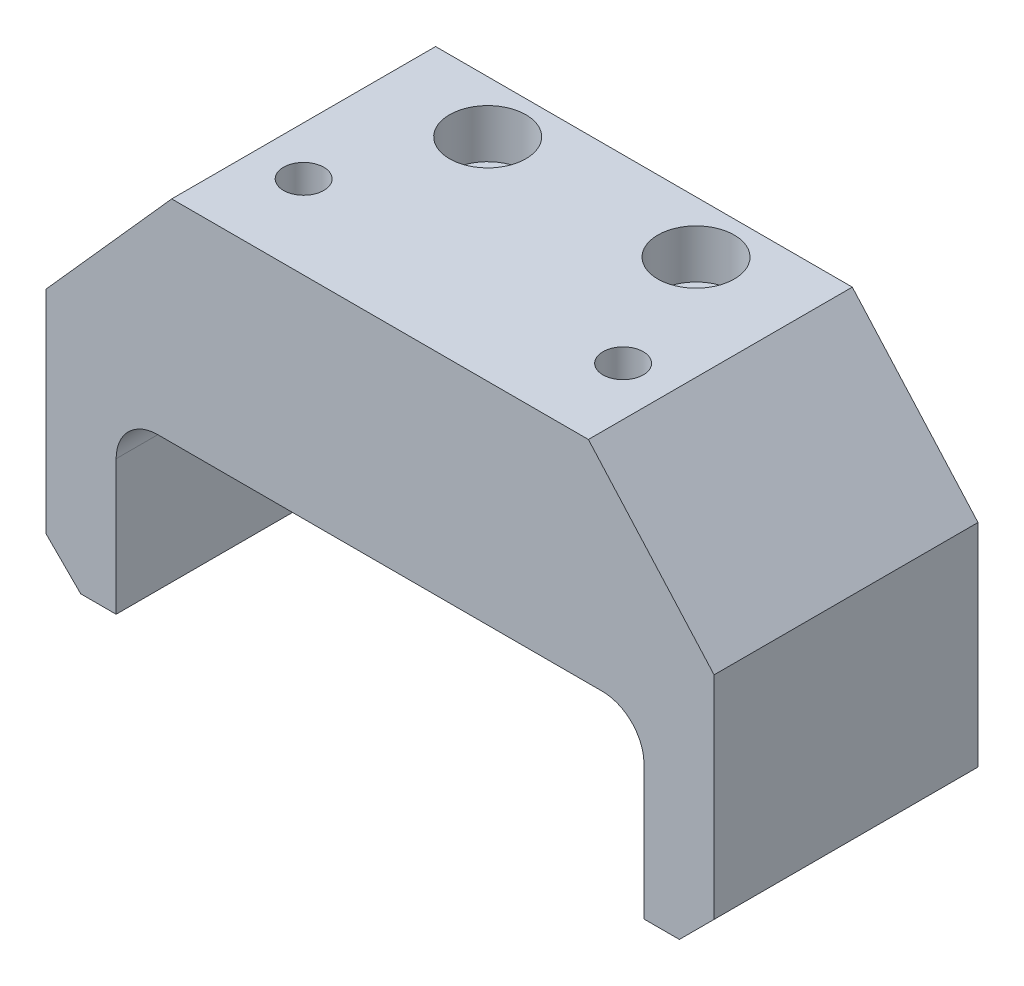
ISO-10303-21;
HEADER;
FILE_DESCRIPTION(('STEP AP214'),'2;1');
FILE_NAME('part.step','',(''),(''),'','','');
FILE_SCHEMA(('AUTOMOTIVE_DESIGN { 1 0 10303 214 1 1 1 1 }'));
ENDSEC;
DATA;
#1=APPLICATION_CONTEXT('core data for automotive mechanical design processes');
#2=APPLICATION_PROTOCOL_DEFINITION('international standard','automotive_design',2000,#1);
#3=PRODUCT_CONTEXT('',#1,'mechanical');
#4=PRODUCT('Part','Part','',(#3));
#5=PRODUCT_RELATED_PRODUCT_CATEGORY('part','',(#4));
#6=PRODUCT_DEFINITION_FORMATION('','',#4);
#7=PRODUCT_DEFINITION_CONTEXT('part definition',#1,'design');
#8=PRODUCT_DEFINITION('design','',#6,#7);
#9=PRODUCT_DEFINITION_SHAPE('','',#8);
#10=(LENGTH_UNIT() NAMED_UNIT(*) SI_UNIT(.MILLI.,.METRE.));
#11=(NAMED_UNIT(*) PLANE_ANGLE_UNIT() SI_UNIT($,.RADIAN.));
#12=(NAMED_UNIT(*) SI_UNIT($,.STERADIAN.) SOLID_ANGLE_UNIT());
#13=UNCERTAINTY_MEASURE_WITH_UNIT(LENGTH_MEASURE(1.E-05),#10,'distance_accuracy_value','');
#14=(GEOMETRIC_REPRESENTATION_CONTEXT(3) GLOBAL_UNCERTAINTY_ASSIGNED_CONTEXT((#13)) GLOBAL_UNIT_ASSIGNED_CONTEXT((#10,
#11,#12)) REPRESENTATION_CONTEXT('',''));
#15=CARTESIAN_POINT('',(0.,0.,0.));
#16=DIRECTION('',(0.,0.,1.));
#17=DIRECTION('',(1.,0.,0.));
#18=AXIS2_PLACEMENT_3D('',#15,#16,#17);
#19=CARTESIAN_POINT('',(15.,-36.,-11.5));
#20=DIRECTION('',(0.,1.,0.));
#21=DIRECTION('',(-1.,0.,0.));
#22=AXIS2_PLACEMENT_3D('',#19,#20,#21);
#23=CYLINDRICAL_SURFACE('',#22,3.05);
#24=CARTESIAN_POINT('',(15.,-24.4,-11.5));
#25=DIRECTION('',(0.,1.,0.));
#26=DIRECTION('',(-1.,0.,0.));
#27=AXIS2_PLACEMENT_3D('',#24,#25,#26);
#28=CIRCLE('',#27,3.05);
#29=CARTESIAN_POINT('',(11.95,-24.4,-11.5));
#30=VERTEX_POINT('',#29);
#31=EDGE_CURVE('E198',#30,#30,#28,.T.);
#32=ORIENTED_EDGE('',*,*,#31,.F.);
#33=EDGE_LOOP('',(#32));
#34=FACE_BOUND('',#33,.T.);
#35=CARTESIAN_POINT('',(15.,-1.,-11.5));
#36=DIRECTION('',(0.,1.,0.));
#37=DIRECTION('',(-1.,0.,0.));
#38=AXIS2_PLACEMENT_3D('',#35,#36,#37);
#39=CIRCLE('',#38,3.05);
#40=CARTESIAN_POINT('',(11.95,-1.,-11.5));
#41=VERTEX_POINT('',#40);
#42=EDGE_CURVE('E200',#41,#41,#39,.F.);
#43=ORIENTED_EDGE('',*,*,#42,.F.);
#44=EDGE_LOOP('',(#43));
#45=FACE_BOUND('',#44,.T.);
#46=ADVANCED_FACE('F35',(#34,#45),#23,.F.);
#47=CARTESIAN_POINT('',(-15.,-36.,-11.5));
#48=DIRECTION('',(0.,1.,0.));
#49=DIRECTION('',(-1.,0.,0.));
#50=AXIS2_PLACEMENT_3D('',#47,#48,#49);
#51=CYLINDRICAL_SURFACE('',#50,3.05);
#52=CARTESIAN_POINT('',(-15.,-24.4,-11.5));
#53=DIRECTION('',(0.,1.,0.));
#54=DIRECTION('',(-1.,0.,0.));
#55=AXIS2_PLACEMENT_3D('',#52,#53,#54);
#56=CIRCLE('',#55,3.05);
#57=CARTESIAN_POINT('',(-18.05,-24.4,-11.5));
#58=VERTEX_POINT('',#57);
#59=EDGE_CURVE('E276',#58,#58,#56,.T.);
#60=ORIENTED_EDGE('',*,*,#59,.F.);
#61=EDGE_LOOP('',(#60));
#62=FACE_BOUND('',#61,.T.);
#63=CARTESIAN_POINT('',(-15.,-1.00000000000001,-11.5));
#64=DIRECTION('',(0.,1.,0.));
#65=DIRECTION('',(-1.,0.,0.));
#66=AXIS2_PLACEMENT_3D('',#63,#64,#65);
#67=CIRCLE('',#66,3.05);
#68=CARTESIAN_POINT('',(-18.05,-1.00000000000001,-11.5));
#69=VERTEX_POINT('',#68);
#70=EDGE_CURVE('E195',#69,#69,#67,.F.);
#71=ORIENTED_EDGE('',*,*,#70,.F.);
#72=EDGE_LOOP('',(#71));
#73=FACE_BOUND('',#72,.T.);
#74=ADVANCED_FACE('F341',(#62,#73),#51,.F.);
#75=CARTESIAN_POINT('',(-48.1,5.99999999999999,19.));
#76=DIRECTION('',(1.,0.,0.));
#77=DIRECTION('',(0.,1.,0.));
#78=AXIS2_PLACEMENT_3D('',#75,#76,#77);
#79=PLANE('',#78);
#80=DIRECTION('',(0.,-1.,0.));
#81=VECTOR('',#80,1.);
#82=CARTESIAN_POINT('',(-48.1,5.99999999999999,-19.));
#83=LINE('',#82,#81);
#84=CARTESIAN_POINT('',(-48.1,-14.3,-19.));
#85=VERTEX_POINT('',#84);
#86=CARTESIAN_POINT('',(-48.1,-44.8,-19.));
#87=VERTEX_POINT('',#86);
#88=EDGE_CURVE('E226',#85,#87,#83,.T.);
#89=ORIENTED_EDGE('',*,*,#88,.T.);
#90=DIRECTION('',(0.,0.,1.));
#91=VECTOR('',#90,1.);
#92=CARTESIAN_POINT('',(-48.1,-44.8,19.));
#93=LINE('',#92,#91);
#94=CARTESIAN_POINT('',(-48.1,-44.8,19.));
#95=VERTEX_POINT('',#94);
#96=EDGE_CURVE('E11',#87,#95,#93,.T.);
#97=ORIENTED_EDGE('',*,*,#96,.T.);
#98=DIRECTION('',(0.,-1.,0.));
#99=VECTOR('',#98,1.);
#100=CARTESIAN_POINT('',(-48.1,5.99999999999999,19.));
#101=LINE('',#100,#99);
#102=CARTESIAN_POINT('',(-48.1,-14.3,19.));
#103=VERTEX_POINT('',#102);
#104=EDGE_CURVE('E161',#103,#95,#101,.T.);
#105=ORIENTED_EDGE('',*,*,#104,.F.);
#106=DIRECTION('',(0.,0.,1.));
#107=VECTOR('',#106,1.);
#108=CARTESIAN_POINT('',(-48.1,-14.3,-19.));
#109=LINE('',#108,#107);
#110=EDGE_CURVE('E268',#85,#103,#109,.T.);
#111=ORIENTED_EDGE('',*,*,#110,.F.);
#112=EDGE_LOOP('',(#89,#97,#105,#111));
#113=FACE_BOUND('',#112,.T.);
#114=ADVANCED_FACE('F346',(#113),#79,.F.);
#115=CARTESIAN_POINT('',(-48.1,-49.8,19.));
#116=DIRECTION('',(0.,1.,0.));
#117=DIRECTION('',(-1.,0.,0.));
#118=AXIS2_PLACEMENT_3D('',#115,#116,#117);
#119=PLANE('',#118);
#120=DIRECTION('',(1.,0.,0.));
#121=VECTOR('',#120,1.);
#122=CARTESIAN_POINT('',(-48.1,-49.8,19.));
#123=LINE('',#122,#121);
#124=CARTESIAN_POINT('',(-43.1,-49.8,19.));
#125=VERTEX_POINT('',#124);
#126=CARTESIAN_POINT('',(-38.,-49.8,19.));
#127=VERTEX_POINT('',#126);
#128=EDGE_CURVE('E164',#125,#127,#123,.T.);
#129=ORIENTED_EDGE('',*,*,#128,.F.);
#130=DIRECTION('',(0.,0.,-1.));
#131=VECTOR('',#130,1.);
#132=CARTESIAN_POINT('',(-43.1,-49.8,19.));
#133=LINE('',#132,#131);
#134=CARTESIAN_POINT('',(-43.1,-49.8,-19.));
#135=VERTEX_POINT('',#134);
#136=EDGE_CURVE('E43',#125,#135,#133,.T.);
#137=ORIENTED_EDGE('',*,*,#136,.T.);
#138=DIRECTION('',(1.,0.,0.));
#139=VECTOR('',#138,1.);
#140=CARTESIAN_POINT('',(-48.1,-49.8,-19.));
#141=LINE('',#140,#139);
#142=CARTESIAN_POINT('',(-38.,-49.8,-19.));
#143=VERTEX_POINT('',#142);
#144=EDGE_CURVE('E221',#135,#143,#141,.T.);
#145=ORIENTED_EDGE('',*,*,#144,.T.);
#146=DIRECTION('',(0.,0.,-1.));
#147=VECTOR('',#146,1.);
#148=CARTESIAN_POINT('',(-38.,-49.8,19.));
#149=LINE('',#148,#147);
#150=EDGE_CURVE('E173',#127,#143,#149,.T.);
#151=ORIENTED_EDGE('',*,*,#150,.F.);
#152=EDGE_LOOP('',(#129,#137,#145,#151));
#153=FACE_BOUND('',#152,.T.);
#154=ADVANCED_FACE('F219',(#153),#119,.F.);
#155=CARTESIAN_POINT('',(-38.,-49.8,19.));
#156=DIRECTION('',(-1.,0.,0.));
#157=DIRECTION('',(0.,0.,1.));
#158=AXIS2_PLACEMENT_3D('',#155,#156,#157);
#159=PLANE('',#158);
#160=DIRECTION('',(0.,1.,0.));
#161=VECTOR('',#160,1.);
#162=CARTESIAN_POINT('',(-38.,-49.8,-19.));
#163=LINE('',#162,#161);
#164=CARTESIAN_POINT('',(-38.,-30.4,-19.));
#165=VERTEX_POINT('',#164);
#166=EDGE_CURVE('E225',#143,#165,#163,.T.);
#167=ORIENTED_EDGE('',*,*,#166,.T.);
#168=DIRECTION('',(0.,0.,-1.));
#169=VECTOR('',#168,1.);
#170=CARTESIAN_POINT('',(-38.,-30.4,19.));
#171=LINE('',#170,#169);
#172=CARTESIAN_POINT('',(-38.,-30.4,19.));
#173=VERTEX_POINT('',#172);
#174=EDGE_CURVE('E184',#165,#173,#171,.F.);
#175=ORIENTED_EDGE('',*,*,#174,.T.);
#176=DIRECTION('',(0.,1.,0.));
#177=VECTOR('',#176,1.);
#178=CARTESIAN_POINT('',(-38.,-49.8,19.));
#179=LINE('',#178,#177);
#180=EDGE_CURVE('E264',#127,#173,#179,.T.);
#181=ORIENTED_EDGE('',*,*,#180,.F.);
#182=ORIENTED_EDGE('',*,*,#150,.T.);
#183=EDGE_LOOP('',(#167,#175,#181,#182));
#184=FACE_BOUND('',#183,.T.);
#185=ADVANCED_FACE('F374',(#184),#159,.F.);
#186=CARTESIAN_POINT('',(-38.,-24.4,19.));
#187=DIRECTION('',(0.,1.,0.));
#188=DIRECTION('',(-1.,0.,0.));
#189=AXIS2_PLACEMENT_3D('',#186,#187,#188);
#190=PLANE('',#189);
#191=ORIENTED_EDGE('',*,*,#31,.T.);
#192=EDGE_LOOP('',(#191));
#193=FACE_BOUND('',#192,.T.);
#194=ORIENTED_EDGE('',*,*,#59,.T.);
#195=EDGE_LOOP('',(#194));
#196=FACE_BOUND('',#195,.T.);
#197=DIRECTION('',(1.,0.,0.));
#198=VECTOR('',#197,1.);
#199=CARTESIAN_POINT('',(-38.,-24.4,-19.));
#200=LINE('',#199,#198);
#201=CARTESIAN_POINT('',(-32.,-24.4,-19.));
#202=VERTEX_POINT('',#201);
#203=CARTESIAN_POINT('',(32.,-24.4,-19.));
#204=VERTEX_POINT('',#203);
#205=EDGE_CURVE('E228',#202,#204,#200,.T.);
#206=ORIENTED_EDGE('',*,*,#205,.T.);
#207=DIRECTION('',(0.,0.,-1.));
#208=VECTOR('',#207,1.);
#209=CARTESIAN_POINT('',(32.,-24.4,19.));
#210=LINE('',#209,#208);
#211=CARTESIAN_POINT('',(32.,-24.4,19.));
#212=VERTEX_POINT('',#211);
#213=EDGE_CURVE('E182',#204,#212,#210,.F.);
#214=ORIENTED_EDGE('',*,*,#213,.T.);
#215=DIRECTION('',(1.,0.,0.));
#216=VECTOR('',#215,1.);
#217=CARTESIAN_POINT('',(-38.,-24.4,19.));
#218=LINE('',#217,#216);
#219=CARTESIAN_POINT('',(-32.,-24.4,19.));
#220=VERTEX_POINT('',#219);
#221=EDGE_CURVE('E261',#220,#212,#218,.T.);
#222=ORIENTED_EDGE('',*,*,#221,.F.);
#223=DIRECTION('',(0.,0.,-1.));
#224=VECTOR('',#223,1.);
#225=CARTESIAN_POINT('',(-32.,-24.4,-19.));
#226=LINE('',#225,#224);
#227=EDGE_CURVE('E179',#220,#202,#226,.T.);
#228=ORIENTED_EDGE('',*,*,#227,.T.);
#229=EDGE_LOOP('',(#206,#214,#222,#228));
#230=FACE_BOUND('',#229,.T.);
#231=ADVANCED_FACE('F370',(#193,#196,#230),#190,.F.);
#232=CARTESIAN_POINT('',(38.,-49.8,19.));
#233=DIRECTION('',(1.,0.,0.));
#234=DIRECTION('',(0.,0.,-1.));
#235=AXIS2_PLACEMENT_3D('',#232,#233,#234);
#236=PLANE('',#235);
#237=DIRECTION('',(0.,-1.,0.));
#238=VECTOR('',#237,1.);
#239=CARTESIAN_POINT('',(38.,-49.8,19.));
#240=LINE('',#239,#238);
#241=CARTESIAN_POINT('',(38.,-30.4,19.));
#242=VERTEX_POINT('',#241);
#243=CARTESIAN_POINT('',(38.,-49.8,19.));
#244=VERTEX_POINT('',#243);
#245=EDGE_CURVE('E257',#242,#244,#240,.T.);
#246=ORIENTED_EDGE('',*,*,#245,.F.);
#247=DIRECTION('',(0.,0.,-1.));
#248=VECTOR('',#247,1.);
#249=CARTESIAN_POINT('',(38.,-30.4,-19.));
#250=LINE('',#249,#248);
#251=CARTESIAN_POINT('',(38.,-30.4,-19.));
#252=VERTEX_POINT('',#251);
#253=EDGE_CURVE('E176',#242,#252,#250,.T.);
#254=ORIENTED_EDGE('',*,*,#253,.T.);
#255=DIRECTION('',(0.,-1.,0.));
#256=VECTOR('',#255,1.);
#257=CARTESIAN_POINT('',(38.,-49.8,-19.));
#258=LINE('',#257,#256);
#259=CARTESIAN_POINT('',(38.,-49.8,-19.));
#260=VERTEX_POINT('',#259);
#261=EDGE_CURVE('E236',#252,#260,#258,.T.);
#262=ORIENTED_EDGE('',*,*,#261,.T.);
#263=DIRECTION('',(0.,0.,-1.));
#264=VECTOR('',#263,1.);
#265=CARTESIAN_POINT('',(38.,-49.8,19.));
#266=LINE('',#265,#264);
#267=EDGE_CURVE('E170',#244,#260,#266,.T.);
#268=ORIENTED_EDGE('',*,*,#267,.F.);
#269=EDGE_LOOP('',(#246,#254,#262,#268));
#270=FACE_BOUND('',#269,.T.);
#271=ADVANCED_FACE('F367',(#270),#236,.F.);
#272=CARTESIAN_POINT('',(48.1,-49.8,19.));
#273=DIRECTION('',(0.,1.,0.));
#274=DIRECTION('',(0.,0.,1.));
#275=AXIS2_PLACEMENT_3D('',#272,#273,#274);
#276=PLANE('',#275);
#277=DIRECTION('',(1.,0.,0.));
#278=VECTOR('',#277,1.);
#279=CARTESIAN_POINT('',(48.1,-49.8,-19.));
#280=LINE('',#279,#278);
#281=CARTESIAN_POINT('',(43.1,-49.8,-19.));
#282=VERTEX_POINT('',#281);
#283=EDGE_CURVE('E166',#260,#282,#280,.T.);
#284=ORIENTED_EDGE('',*,*,#283,.T.);
#285=DIRECTION('',(0.,0.,1.));
#286=VECTOR('',#285,1.);
#287=CARTESIAN_POINT('',(43.1,-49.8,19.));
#288=LINE('',#287,#286);
#289=CARTESIAN_POINT('',(43.1,-49.8,19.));
#290=VERTEX_POINT('',#289);
#291=EDGE_CURVE('E211',#282,#290,#288,.T.);
#292=ORIENTED_EDGE('',*,*,#291,.T.);
#293=DIRECTION('',(1.,0.,0.));
#294=VECTOR('',#293,1.);
#295=CARTESIAN_POINT('',(48.1,-49.8,19.));
#296=LINE('',#295,#294);
#297=EDGE_CURVE('E253',#244,#290,#296,.T.);
#298=ORIENTED_EDGE('',*,*,#297,.F.);
#299=ORIENTED_EDGE('',*,*,#267,.T.);
#300=EDGE_LOOP('',(#284,#292,#298,#299));
#301=FACE_BOUND('',#300,.T.);
#302=ADVANCED_FACE('F241',(#301),#276,.F.);
#303=CARTESIAN_POINT('',(48.1,6.,19.));
#304=DIRECTION('',(-1.,0.,0.));
#305=DIRECTION('',(0.,-1.,0.));
#306=AXIS2_PLACEMENT_3D('',#303,#304,#305);
#307=PLANE('',#306);
#308=DIRECTION('',(0.,1.,0.));
#309=VECTOR('',#308,1.);
#310=CARTESIAN_POINT('',(48.1,6.,19.));
#311=LINE('',#310,#309);
#312=CARTESIAN_POINT('',(48.1,-44.8,19.));
#313=VERTEX_POINT('',#312);
#314=CARTESIAN_POINT('',(48.1,-14.3,19.));
#315=VERTEX_POINT('',#314);
#316=EDGE_CURVE('E252',#313,#315,#311,.T.);
#317=ORIENTED_EDGE('',*,*,#316,.F.);
#318=DIRECTION('',(0.,0.,-1.));
#319=VECTOR('',#318,1.);
#320=CARTESIAN_POINT('',(48.1,-44.8,19.));
#321=LINE('',#320,#319);
#322=CARTESIAN_POINT('',(48.1,-44.8,-19.));
#323=VERTEX_POINT('',#322);
#324=EDGE_CURVE('E194',#313,#323,#321,.T.);
#325=ORIENTED_EDGE('',*,*,#324,.T.);
#326=DIRECTION('',(0.,1.,0.));
#327=VECTOR('',#326,1.);
#328=CARTESIAN_POINT('',(48.1,6.,-19.));
#329=LINE('',#328,#327);
#330=CARTESIAN_POINT('',(48.1,-14.3,-19.));
#331=VERTEX_POINT('',#330);
#332=EDGE_CURVE('E162',#323,#331,#329,.T.);
#333=ORIENTED_EDGE('',*,*,#332,.T.);
#334=DIRECTION('',(0.,0.,1.));
#335=VECTOR('',#334,1.);
#336=CARTESIAN_POINT('',(48.1,-14.3,-19.));
#337=LINE('',#336,#335);
#338=EDGE_CURVE('E143',#331,#315,#337,.T.);
#339=ORIENTED_EDGE('',*,*,#338,.T.);
#340=EDGE_LOOP('',(#317,#325,#333,#339));
#341=FACE_BOUND('',#340,.T.);
#342=ADVANCED_FACE('F255',(#341),#307,.F.);
#343=CARTESIAN_POINT('',(48.1,6.,19.));
#344=DIRECTION('',(0.,-1.,0.));
#345=DIRECTION('',(1.,0.,0.));
#346=AXIS2_PLACEMENT_3D('',#343,#344,#345);
#347=PLANE('',#346);
#348=CARTESIAN_POINT('',(23.,6.,7.));
#349=DIRECTION('',(0.,1.,0.));
#350=DIRECTION('',(1.,0.,0.));
#351=AXIS2_PLACEMENT_3D('',#348,#349,#350);
#352=CIRCLE('',#351,2.9);
#353=CARTESIAN_POINT('',(25.9,6.,7.));
#354=VERTEX_POINT('',#353);
#355=EDGE_CURVE('E298',#354,#354,#352,.T.);
#356=ORIENTED_EDGE('',*,*,#355,.F.);
#357=EDGE_LOOP('',(#356));
#358=FACE_BOUND('',#357,.T.);
#359=CARTESIAN_POINT('',(-23.,5.99999999999999,7.));
#360=DIRECTION('',(0.,1.,0.));
#361=DIRECTION('',(-1.,0.,0.));
#362=AXIS2_PLACEMENT_3D('',#359,#360,#361);
#363=CIRCLE('',#362,2.9);
#364=CARTESIAN_POINT('',(-25.9,5.99999999999999,7.));
#365=VERTEX_POINT('',#364);
#366=EDGE_CURVE('E292',#365,#365,#363,.T.);
#367=ORIENTED_EDGE('',*,*,#366,.F.);
#368=EDGE_LOOP('',(#367));
#369=FACE_BOUND('',#368,.T.);
#370=CARTESIAN_POINT('',(15.,6.,-11.5));
#371=DIRECTION('',(0.,1.,0.));
#372=DIRECTION('',(-1.,0.,0.));
#373=AXIS2_PLACEMENT_3D('',#370,#371,#372);
#374=CIRCLE('',#373,5.5);
#375=CARTESIAN_POINT('',(9.50000000000001,6.,-11.5));
#376=VERTEX_POINT('',#375);
#377=EDGE_CURVE('E286',#376,#376,#374,.T.);
#378=ORIENTED_EDGE('',*,*,#377,.F.);
#379=EDGE_LOOP('',(#378));
#380=FACE_BOUND('',#379,.T.);
#381=CARTESIAN_POINT('',(-15.,5.99999999999999,-11.5));
#382=DIRECTION('',(0.,1.,0.));
#383=DIRECTION('',(-1.,0.,0.));
#384=AXIS2_PLACEMENT_3D('',#381,#382,#383);
#385=CIRCLE('',#384,5.5);
#386=CARTESIAN_POINT('',(-20.5,5.99999999999999,-11.5));
#387=VERTEX_POINT('',#386);
#388=EDGE_CURVE('E203',#387,#387,#385,.T.);
#389=ORIENTED_EDGE('',*,*,#388,.F.);
#390=EDGE_LOOP('',(#389));
#391=FACE_BOUND('',#390,.T.);
#392=DIRECTION('',(-1.,0.,0.));
#393=VECTOR('',#392,1.);
#394=CARTESIAN_POINT('',(48.1,6.,19.));
#395=LINE('',#394,#393);
#396=CARTESIAN_POINT('',(30.,6.00000000000001,19.));
#397=VERTEX_POINT('',#396);
#398=CARTESIAN_POINT('',(-30.,6.00000000000001,19.));
#399=VERTEX_POINT('',#398);
#400=EDGE_CURVE('E155',#397,#399,#395,.T.);
#401=ORIENTED_EDGE('',*,*,#400,.F.);
#402=DIRECTION('',(0.,0.,1.));
#403=VECTOR('',#402,1.);
#404=CARTESIAN_POINT('',(30.,6.00000000000001,-19.));
#405=LINE('',#404,#403);
#406=CARTESIAN_POINT('',(30.,6.00000000000001,-19.));
#407=VERTEX_POINT('',#406);
#408=EDGE_CURVE('E140',#407,#397,#405,.T.);
#409=ORIENTED_EDGE('',*,*,#408,.F.);
#410=DIRECTION('',(-1.,0.,0.));
#411=VECTOR('',#410,1.);
#412=CARTESIAN_POINT('',(48.1,6.,-19.));
#413=LINE('',#412,#411);
#414=CARTESIAN_POINT('',(-30.,6.,-19.));
#415=VERTEX_POINT('',#414);
#416=EDGE_CURVE('E153',#407,#415,#413,.T.);
#417=ORIENTED_EDGE('',*,*,#416,.T.);
#418=DIRECTION('',(0.,0.,1.));
#419=VECTOR('',#418,1.);
#420=CARTESIAN_POINT('',(-30.,6.00000000000001,-19.));
#421=LINE('',#420,#419);
#422=EDGE_CURVE('E230',#415,#399,#421,.T.);
#423=ORIENTED_EDGE('',*,*,#422,.T.);
#424=EDGE_LOOP('',(#401,#409,#417,#423));
#425=FACE_BOUND('',#424,.T.);
#426=ADVANCED_FACE('F151',(#358,#369,#380,#391,#425),#347,.F.);
#427=CARTESIAN_POINT('',(0.,0.,19.));
#428=DIRECTION('',(0.,0.,1.));
#429=DIRECTION('',(1.,0.,0.));
#430=AXIS2_PLACEMENT_3D('',#427,#428,#429);
#431=PLANE('',#430);
#432=ORIENTED_EDGE('',*,*,#297,.T.);
#433=DIRECTION('',(-0.70710678118655,-0.707106781186546,0.));
#434=VECTOR('',#433,1.);
#435=CARTESIAN_POINT('',(46.4499999999999,-46.4500000000001,19.));
#436=LINE('',#435,#434);
#437=EDGE_CURVE('E214',#290,#313,#436,.F.);
#438=ORIENTED_EDGE('',*,*,#437,.T.);
#439=ORIENTED_EDGE('',*,*,#316,.T.);
#440=DIRECTION('',(0.665504146159,-0.746394152874458,0.));
#441=VECTOR('',#440,1.);
#442=CARTESIAN_POINT('',(30.,6.00000000000001,19.));
#443=LINE('',#442,#441);
#444=EDGE_CURVE('E147',#397,#315,#443,.T.);
#445=ORIENTED_EDGE('',*,*,#444,.F.);
#446=ORIENTED_EDGE('',*,*,#400,.T.);
#447=DIRECTION('',(0.665504146159,0.746394152874458,0.));
#448=VECTOR('',#447,1.);
#449=CARTESIAN_POINT('',(-30.,6.00000000000001,19.));
#450=LINE('',#449,#448);
#451=EDGE_CURVE('E271',#103,#399,#450,.T.);
#452=ORIENTED_EDGE('',*,*,#451,.F.);
#453=ORIENTED_EDGE('',*,*,#104,.T.);
#454=DIRECTION('',(-0.707106781186547,0.707106781186549,0.));
#455=VECTOR('',#454,1.);
#456=CARTESIAN_POINT('',(-46.4500000000001,-46.4499999999999,19.));
#457=LINE('',#456,#455);
#458=EDGE_CURVE('E50',#95,#125,#457,.F.);
#459=ORIENTED_EDGE('',*,*,#458,.T.);
#460=ORIENTED_EDGE('',*,*,#128,.T.);
#461=ORIENTED_EDGE('',*,*,#180,.T.);
#462=CARTESIAN_POINT('',(-32.,-30.4,19.));
#463=DIRECTION('',(0.,0.,1.));
#464=DIRECTION('',(1.,0.,0.));
#465=AXIS2_PLACEMENT_3D('',#462,#463,#464);
#466=CIRCLE('',#465,6.);
#467=EDGE_CURVE('E192',#173,#220,#466,.F.);
#468=ORIENTED_EDGE('',*,*,#467,.T.);
#469=ORIENTED_EDGE('',*,*,#221,.T.);
#470=CARTESIAN_POINT('',(32.,-30.4,19.));
#471=DIRECTION('',(0.,0.,1.));
#472=DIRECTION('',(1.,0.,0.));
#473=AXIS2_PLACEMENT_3D('',#470,#471,#472);
#474=CIRCLE('',#473,6.);
#475=EDGE_CURVE('E188',#212,#242,#474,.F.);
#476=ORIENTED_EDGE('',*,*,#475,.T.);
#477=ORIENTED_EDGE('',*,*,#245,.T.);
#478=EDGE_LOOP('',(#432,#438,#439,#445,#446,#452,#453,#459,#460,#461,#468,#469,#476,#477));
#479=FACE_BOUND('',#478,.T.);
#480=ADVANCED_FACE('F251',(#479),#431,.T.);
#481=CARTESIAN_POINT('',(0.,0.,-19.));
#482=DIRECTION('',(0.,0.,1.));
#483=DIRECTION('',(1.,0.,0.));
#484=AXIS2_PLACEMENT_3D('',#481,#482,#483);
#485=PLANE('',#484);
#486=ORIENTED_EDGE('',*,*,#332,.F.);
#487=DIRECTION('',(0.70710678118655,0.707106781186546,0.));
#488=VECTOR('',#487,1.);
#489=CARTESIAN_POINT('',(48.1,-44.8,-19.));
#490=LINE('',#489,#488);
#491=EDGE_CURVE('E209',#323,#282,#490,.F.);
#492=ORIENTED_EDGE('',*,*,#491,.T.);
#493=ORIENTED_EDGE('',*,*,#283,.F.);
#494=ORIENTED_EDGE('',*,*,#261,.F.);
#495=CARTESIAN_POINT('',(32.,-30.4,-19.));
#496=DIRECTION('',(0.,0.,1.));
#497=DIRECTION('',(1.,0.,0.));
#498=AXIS2_PLACEMENT_3D('',#495,#496,#497);
#499=CIRCLE('',#498,6.);
#500=EDGE_CURVE('E186',#252,#204,#499,.T.);
#501=ORIENTED_EDGE('',*,*,#500,.T.);
#502=ORIENTED_EDGE('',*,*,#205,.F.);
#503=CARTESIAN_POINT('',(-32.,-30.4,-19.));
#504=DIRECTION('',(0.,0.,1.));
#505=DIRECTION('',(1.,0.,0.));
#506=AXIS2_PLACEMENT_3D('',#503,#504,#505);
#507=CIRCLE('',#506,6.);
#508=EDGE_CURVE('E190',#202,#165,#507,.T.);
#509=ORIENTED_EDGE('',*,*,#508,.T.);
#510=ORIENTED_EDGE('',*,*,#166,.F.);
#511=ORIENTED_EDGE('',*,*,#144,.F.);
#512=DIRECTION('',(0.707106781186547,-0.707106781186549,0.));
#513=VECTOR('',#512,1.);
#514=CARTESIAN_POINT('',(-43.1,-49.8,-19.));
#515=LINE('',#514,#513);
#516=EDGE_CURVE('E207',#135,#87,#515,.F.);
#517=ORIENTED_EDGE('',*,*,#516,.T.);
#518=ORIENTED_EDGE('',*,*,#88,.F.);
#519=DIRECTION('',(0.665504146159,0.746394152874458,0.));
#520=VECTOR('',#519,1.);
#521=CARTESIAN_POINT('',(-30.,6.00000000000001,-19.));
#522=LINE('',#521,#520);
#523=EDGE_CURVE('E160',#85,#415,#522,.T.);
#524=ORIENTED_EDGE('',*,*,#523,.T.);
#525=ORIENTED_EDGE('',*,*,#416,.F.);
#526=DIRECTION('',(0.665504146159,-0.746394152874458,0.));
#527=VECTOR('',#526,1.);
#528=CARTESIAN_POINT('',(30.,6.00000000000001,-19.));
#529=LINE('',#528,#527);
#530=EDGE_CURVE('E136',#407,#331,#529,.T.);
#531=ORIENTED_EDGE('',*,*,#530,.T.);
#532=EDGE_LOOP('',(#486,#492,#493,#494,#501,#502,#509,#510,#511,#517,#518,#524,#525,#531));
#533=FACE_BOUND('',#532,.T.);
#534=ADVANCED_FACE('F158',(#533),#485,.F.);
#535=CARTESIAN_POINT('',(-30.,6.00000000000001,-19.));
#536=DIRECTION('',(0.746394152874458,-0.665504146159,0.));
#537=DIRECTION('',(0.665504146159,0.746394152874458,0.));
#538=AXIS2_PLACEMENT_3D('',#535,#536,#537);
#539=PLANE('',#538);
#540=ORIENTED_EDGE('',*,*,#451,.T.);
#541=ORIENTED_EDGE('',*,*,#422,.F.);
#542=ORIENTED_EDGE('',*,*,#523,.F.);
#543=ORIENTED_EDGE('',*,*,#110,.T.);
#544=EDGE_LOOP('',(#540,#541,#542,#543));
#545=FACE_BOUND('',#544,.T.);
#546=ADVANCED_FACE('F355',(#545),#539,.F.);
#547=CARTESIAN_POINT('',(30.,6.00000000000001,-19.));
#548=DIRECTION('',(-0.746394152874458,-0.665504146159,0.));
#549=DIRECTION('',(0.665504146159,-0.746394152874458,0.));
#550=AXIS2_PLACEMENT_3D('',#547,#548,#549);
#551=PLANE('',#550);
#552=ORIENTED_EDGE('',*,*,#444,.T.);
#553=ORIENTED_EDGE('',*,*,#338,.F.);
#554=ORIENTED_EDGE('',*,*,#530,.F.);
#555=ORIENTED_EDGE('',*,*,#408,.T.);
#556=EDGE_LOOP('',(#552,#553,#554,#555));
#557=FACE_BOUND('',#556,.T.);
#558=ADVANCED_FACE('F139',(#557),#551,.F.);
#559=CARTESIAN_POINT('',(32.,-30.4,19.));
#560=DIRECTION('',(0.,0.,1.));
#561=DIRECTION('',(1.,0.,0.));
#562=AXIS2_PLACEMENT_3D('',#559,#560,#561);
#563=CYLINDRICAL_SURFACE('',#562,6.);
#564=ORIENTED_EDGE('',*,*,#475,.F.);
#565=ORIENTED_EDGE('',*,*,#213,.F.);
#566=ORIENTED_EDGE('',*,*,#500,.F.);
#567=ORIENTED_EDGE('',*,*,#253,.F.);
#568=EDGE_LOOP('',(#564,#565,#566,#567));
#569=FACE_BOUND('',#568,.T.);
#570=ADVANCED_FACE('F354',(#569),#563,.F.);
#571=CARTESIAN_POINT('',(-32.,-30.4,19.));
#572=DIRECTION('',(0.,0.,1.));
#573=DIRECTION('',(1.,0.,0.));
#574=AXIS2_PLACEMENT_3D('',#571,#572,#573);
#575=CYLINDRICAL_SURFACE('',#574,6.);
#576=ORIENTED_EDGE('',*,*,#467,.F.);
#577=ORIENTED_EDGE('',*,*,#174,.F.);
#578=ORIENTED_EDGE('',*,*,#508,.F.);
#579=ORIENTED_EDGE('',*,*,#227,.F.);
#580=EDGE_LOOP('',(#576,#577,#578,#579));
#581=FACE_BOUND('',#580,.T.);
#582=ADVANCED_FACE('F335',(#581),#575,.F.);
#583=CARTESIAN_POINT('',(-15.,-1.00000000000001,-11.5));
#584=DIRECTION('',(0.,1.,0.));
#585=DIRECTION('',(-1.,0.,0.));
#586=AXIS2_PLACEMENT_3D('',#583,#584,#585);
#587=PLANE('',#586);
#588=CARTESIAN_POINT('',(-15.,-1.00000000000001,-11.5));
#589=DIRECTION('',(0.,1.,0.));
#590=DIRECTION('',(-1.,0.,0.));
#591=AXIS2_PLACEMENT_3D('',#588,#589,#590);
#592=CIRCLE('',#591,5.5);
#593=CARTESIAN_POINT('',(-20.5,-1.00000000000001,-11.5));
#594=VERTEX_POINT('',#593);
#595=EDGE_CURVE('E199',#594,#594,#592,.T.);
#596=ORIENTED_EDGE('',*,*,#595,.T.);
#597=EDGE_LOOP('',(#596));
#598=FACE_BOUND('',#597,.T.);
#599=ORIENTED_EDGE('',*,*,#70,.T.);
#600=EDGE_LOOP('',(#599));
#601=FACE_BOUND('',#600,.T.);
#602=ADVANCED_FACE('F325',(#598,#601),#587,.T.);
#603=CARTESIAN_POINT('',(-15.,-1.00000000000001,-11.5));
#604=DIRECTION('',(0.,1.,0.));
#605=DIRECTION('',(-1.,0.,0.));
#606=AXIS2_PLACEMENT_3D('',#603,#604,#605);
#607=CYLINDRICAL_SURFACE('',#606,5.5);
#608=ORIENTED_EDGE('',*,*,#595,.F.);
#609=EDGE_LOOP('',(#608));
#610=FACE_BOUND('',#609,.T.);
#611=ORIENTED_EDGE('',*,*,#388,.T.);
#612=EDGE_LOOP('',(#611));
#613=FACE_BOUND('',#612,.T.);
#614=ADVANCED_FACE('F322',(#610,#613),#607,.F.);
#615=CARTESIAN_POINT('',(15.,-1.,-11.5));
#616=DIRECTION('',(0.,1.,0.));
#617=DIRECTION('',(-1.,0.,0.));
#618=AXIS2_PLACEMENT_3D('',#615,#616,#617);
#619=PLANE('',#618);
#620=CARTESIAN_POINT('',(15.,-1.,-11.5));
#621=DIRECTION('',(0.,1.,0.));
#622=DIRECTION('',(-1.,0.,0.));
#623=AXIS2_PLACEMENT_3D('',#620,#621,#622);
#624=CIRCLE('',#623,5.5);
#625=CARTESIAN_POINT('',(9.50000000000001,-1.,-11.5));
#626=VERTEX_POINT('',#625);
#627=EDGE_CURVE('E204',#626,#626,#624,.T.);
#628=ORIENTED_EDGE('',*,*,#627,.T.);
#629=EDGE_LOOP('',(#628));
#630=FACE_BOUND('',#629,.T.);
#631=ORIENTED_EDGE('',*,*,#42,.T.);
#632=EDGE_LOOP('',(#631));
#633=FACE_BOUND('',#632,.T.);
#634=ADVANCED_FACE('F324',(#630,#633),#619,.T.);
#635=CARTESIAN_POINT('',(15.,-1.,-11.5));
#636=DIRECTION('',(0.,1.,0.));
#637=DIRECTION('',(-1.,0.,0.));
#638=AXIS2_PLACEMENT_3D('',#635,#636,#637);
#639=CYLINDRICAL_SURFACE('',#638,5.5);
#640=ORIENTED_EDGE('',*,*,#627,.F.);
#641=EDGE_LOOP('',(#640));
#642=FACE_BOUND('',#641,.T.);
#643=ORIENTED_EDGE('',*,*,#377,.T.);
#644=EDGE_LOOP('',(#643));
#645=FACE_BOUND('',#644,.T.);
#646=ADVANCED_FACE('F332',(#642,#645),#639,.F.);
#647=CARTESIAN_POINT('',(-23.,-17.,7.));
#648=DIRECTION('',(0.,1.,0.));
#649=DIRECTION('',(-1.,0.,0.));
#650=AXIS2_PLACEMENT_3D('',#647,#648,#649);
#651=CYLINDRICAL_SURFACE('',#650,2.9);
#652=CARTESIAN_POINT('',(-23.,-17.,7.));
#653=DIRECTION('',(0.,1.,0.));
#654=DIRECTION('',(-1.,0.,0.));
#655=AXIS2_PLACEMENT_3D('',#652,#653,#654);
#656=CIRCLE('',#655,2.9);
#657=CARTESIAN_POINT('',(-25.9,-17.,7.));
#658=VERTEX_POINT('',#657);
#659=EDGE_CURVE('E289',#658,#658,#656,.T.);
#660=ORIENTED_EDGE('',*,*,#659,.F.);
#661=EDGE_LOOP('',(#660));
#662=FACE_BOUND('',#661,.T.);
#663=ORIENTED_EDGE('',*,*,#366,.T.);
#664=EDGE_LOOP('',(#663));
#665=FACE_BOUND('',#664,.T.);
#666=ADVANCED_FACE('F399',(#662,#665),#651,.F.);
#667=CARTESIAN_POINT('',(-23.,-17.,7.));
#668=DIRECTION('',(0.,1.,0.));
#669=DIRECTION('',(-1.,0.,0.));
#670=AXIS2_PLACEMENT_3D('',#667,#668,#669);
#671=PLANE('',#670);
#672=ORIENTED_EDGE('',*,*,#659,.T.);
#673=EDGE_LOOP('',(#672));
#674=FACE_BOUND('',#673,.T.);
#675=ADVANCED_FACE('F309',(#674),#671,.T.);
#676=CARTESIAN_POINT('',(23.,-17.,7.));
#677=DIRECTION('',(0.,1.,0.));
#678=DIRECTION('',(-1.,0.,0.));
#679=AXIS2_PLACEMENT_3D('',#676,#677,#678);
#680=CYLINDRICAL_SURFACE('',#679,2.9);
#681=CARTESIAN_POINT('',(23.,-17.,7.));
#682=DIRECTION('',(0.,1.,0.));
#683=DIRECTION('',(1.,0.,0.));
#684=AXIS2_PLACEMENT_3D('',#681,#682,#683);
#685=CIRCLE('',#684,2.9);
#686=CARTESIAN_POINT('',(25.9,-17.,7.));
#687=VERTEX_POINT('',#686);
#688=EDGE_CURVE('E295',#687,#687,#685,.T.);
#689=ORIENTED_EDGE('',*,*,#688,.F.);
#690=EDGE_LOOP('',(#689));
#691=FACE_BOUND('',#690,.T.);
#692=ORIENTED_EDGE('',*,*,#355,.T.);
#693=EDGE_LOOP('',(#692));
#694=FACE_BOUND('',#693,.T.);
#695=ADVANCED_FACE('F306',(#691,#694),#680,.F.);
#696=CARTESIAN_POINT('',(23.,-17.,7.));
#697=DIRECTION('',(0.,-1.,0.));
#698=DIRECTION('',(1.,0.,0.));
#699=AXIS2_PLACEMENT_3D('',#696,#697,#698);
#700=PLANE('',#699);
#701=ORIENTED_EDGE('',*,*,#688,.T.);
#702=EDGE_LOOP('',(#701));
#703=FACE_BOUND('',#702,.T.);
#704=ADVANCED_FACE('F304',(#703),#700,.F.);
#705=CARTESIAN_POINT('',(48.1,-44.8,19.));
#706=DIRECTION('',(-0.707106781186545,0.707106781186549,0.));
#707=DIRECTION('',(0.,0.,-1.));
#708=AXIS2_PLACEMENT_3D('',#705,#706,#707);
#709=PLANE('',#708);
#710=ORIENTED_EDGE('',*,*,#437,.F.);
#711=ORIENTED_EDGE('',*,*,#291,.F.);
#712=ORIENTED_EDGE('',*,*,#491,.F.);
#713=ORIENTED_EDGE('',*,*,#324,.F.);
#714=EDGE_LOOP('',(#710,#711,#712,#713));
#715=FACE_BOUND('',#714,.T.);
#716=ADVANCED_FACE('F248',(#715),#709,.F.);
#717=CARTESIAN_POINT('',(-43.1,-49.8,19.));
#718=DIRECTION('',(0.707106781186548,0.707106781186546,0.));
#719=DIRECTION('',(0.,0.,-1.));
#720=AXIS2_PLACEMENT_3D('',#717,#718,#719);
#721=PLANE('',#720);
#722=ORIENTED_EDGE('',*,*,#458,.F.);
#723=ORIENTED_EDGE('',*,*,#96,.F.);
#724=ORIENTED_EDGE('',*,*,#516,.F.);
#725=ORIENTED_EDGE('',*,*,#136,.F.);
#726=EDGE_LOOP('',(#722,#723,#724,#725));
#727=FACE_BOUND('',#726,.T.);
#728=ADVANCED_FACE('F37',(#727),#721,.F.);
#729=CLOSED_SHELL('',(#46,#74,#114,#154,#185,#231,#271,#302,#342,#426,#480,#534,#546,#558,#570,
#582,#602,#614,#634,#646,#666,#675,#695,#704,#716,#728));
#730=MANIFOLD_SOLID_BREP('B2',#729);
#731=ADVANCED_BREP_SHAPE_REPRESENTATION('',(#18,#730),#14);
#732=SHAPE_DEFINITION_REPRESENTATION(#9,#731);
ENDSEC;
END-ISO-10303-21;
